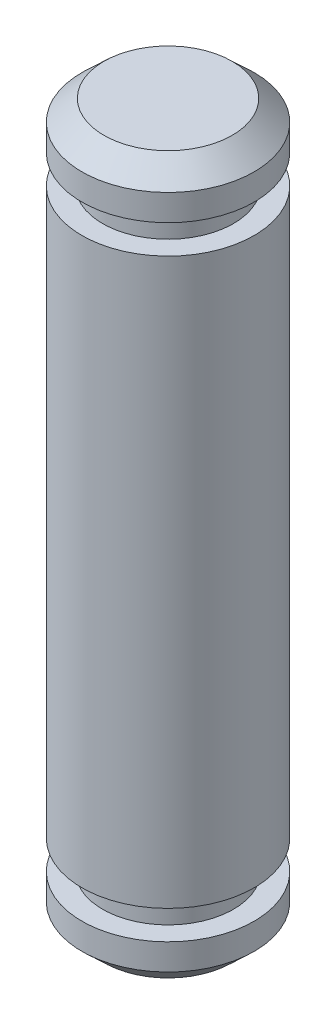
ISO-10303-21;
HEADER;
FILE_DESCRIPTION(('STEP AP214'),'2;1');
FILE_NAME('part.step','',(''),(''),'','','');
FILE_SCHEMA(('AUTOMOTIVE_DESIGN { 1 0 10303 214 1 1 1 1 }'));
ENDSEC;
DATA;
#1=APPLICATION_CONTEXT('core data for automotive mechanical design processes');
#2=APPLICATION_PROTOCOL_DEFINITION('international standard','automotive_design',2000,#1);
#3=PRODUCT_CONTEXT('',#1,'mechanical');
#4=PRODUCT('Part','Part','',(#3));
#5=PRODUCT_RELATED_PRODUCT_CATEGORY('part','',(#4));
#6=PRODUCT_DEFINITION_FORMATION('','',#4);
#7=PRODUCT_DEFINITION_CONTEXT('part definition',#1,'design');
#8=PRODUCT_DEFINITION('design','',#6,#7);
#9=PRODUCT_DEFINITION_SHAPE('','',#8);
#10=(LENGTH_UNIT() NAMED_UNIT(*) SI_UNIT(.MILLI.,.METRE.));
#11=(NAMED_UNIT(*) PLANE_ANGLE_UNIT() SI_UNIT($,.RADIAN.));
#12=(NAMED_UNIT(*) SI_UNIT($,.STERADIAN.) SOLID_ANGLE_UNIT());
#13=UNCERTAINTY_MEASURE_WITH_UNIT(LENGTH_MEASURE(1.E-05),#10,'distance_accuracy_value','');
#14=(GEOMETRIC_REPRESENTATION_CONTEXT(3) GLOBAL_UNCERTAINTY_ASSIGNED_CONTEXT((#13)) GLOBAL_UNIT_ASSIGNED_CONTEXT((#10,
#11,#12)) REPRESENTATION_CONTEXT('',''));
#15=CARTESIAN_POINT('',(0.,0.,0.));
#16=DIRECTION('',(0.,0.,1.));
#17=DIRECTION('',(1.,0.,0.));
#18=AXIS2_PLACEMENT_3D('',#15,#16,#17);
#19=CARTESIAN_POINT('',(-1.5875,5.207,0.));
#20=DIRECTION('',(0.,-1.,0.));
#21=DIRECTION('',(0.,0.,-1.));
#22=AXIS2_PLACEMENT_3D('',#19,#20,#21);
#23=PLANE('',#22);
#24=CARTESIAN_POINT('',(0.,5.207,0.));
#25=DIRECTION('',(0.,-1.,0.));
#26=DIRECTION('',(0.,0.,-1.));
#27=AXIS2_PLACEMENT_3D('',#24,#25,#26);
#28=CIRCLE('',#27,1.5875);
#29=CARTESIAN_POINT('',(0.,5.207,-1.5875));
#30=VERTEX_POINT('',#29);
#31=EDGE_CURVE('E10',#30,#30,#28,.T.);
#32=ORIENTED_EDGE('',*,*,#31,.F.);
#33=EDGE_LOOP('',(#32));
#34=FACE_BOUND('',#33,.T.);
#35=CARTESIAN_POINT('',(0.,5.207,0.));
#36=DIRECTION('',(0.,-1.,0.));
#37=DIRECTION('',(0.,0.,-1.));
#38=AXIS2_PLACEMENT_3D('',#35,#36,#37);
#39=CIRCLE('',#38,1.2065);
#40=CARTESIAN_POINT('',(0.,5.207,-1.2065));
#41=VERTEX_POINT('',#40);
#42=EDGE_CURVE('E71',#41,#41,#39,.T.);
#43=ORIENTED_EDGE('',*,*,#42,.T.);
#44=EDGE_LOOP('',(#43));
#45=FACE_BOUND('',#44,.T.);
#46=ADVANCED_FACE('F31',(#34,#45),#23,.F.);
#47=CARTESIAN_POINT('',(0.,0.,0.));
#48=DIRECTION('',(0.,-1.,0.));
#49=DIRECTION('',(0.,0.,-1.));
#50=AXIS2_PLACEMENT_3D('',#47,#48,#49);
#51=CYLINDRICAL_SURFACE('',#50,1.5875);
#52=CARTESIAN_POINT('',(0.,-5.207,0.));
#53=DIRECTION('',(0.,-1.,0.));
#54=DIRECTION('',(0.,0.,-1.));
#55=AXIS2_PLACEMENT_3D('',#52,#53,#54);
#56=CIRCLE('',#55,1.5875);
#57=CARTESIAN_POINT('',(0.,-5.207,-1.5875));
#58=VERTEX_POINT('',#57);
#59=EDGE_CURVE('E37',#58,#58,#56,.T.);
#60=ORIENTED_EDGE('',*,*,#59,.F.);
#61=EDGE_LOOP('',(#60));
#62=FACE_BOUND('',#61,.T.);
#63=ORIENTED_EDGE('',*,*,#31,.T.);
#64=EDGE_LOOP('',(#63));
#65=FACE_BOUND('',#64,.T.);
#66=ADVANCED_FACE('F111',(#62,#65),#51,.T.);
#67=CARTESIAN_POINT('',(-1.5875,-5.207,0.));
#68=DIRECTION('',(0.,1.,0.));
#69=DIRECTION('',(0.,0.,1.));
#70=AXIS2_PLACEMENT_3D('',#67,#68,#69);
#71=PLANE('',#70);
#72=CARTESIAN_POINT('',(0.,-5.207,0.));
#73=DIRECTION('',(0.,-1.,0.));
#74=DIRECTION('',(0.,0.,-1.));
#75=AXIS2_PLACEMENT_3D('',#72,#73,#74);
#76=CIRCLE('',#75,1.2065);
#77=CARTESIAN_POINT('',(0.,-5.207,-1.2065));
#78=VERTEX_POINT('',#77);
#79=EDGE_CURVE('E41',#78,#78,#76,.T.);
#80=ORIENTED_EDGE('',*,*,#79,.F.);
#81=EDGE_LOOP('',(#80));
#82=FACE_BOUND('',#81,.T.);
#83=ORIENTED_EDGE('',*,*,#59,.T.);
#84=EDGE_LOOP('',(#83));
#85=FACE_BOUND('',#84,.T.);
#86=ADVANCED_FACE('F116',(#82,#85),#71,.F.);
#87=CARTESIAN_POINT('',(0.,0.,0.));
#88=DIRECTION('',(0.,-1.,0.));
#89=DIRECTION('',(0.,0.,-1.));
#90=AXIS2_PLACEMENT_3D('',#87,#88,#89);
#91=CYLINDRICAL_SURFACE('',#90,1.2065);
#92=CARTESIAN_POINT('',(0.,-5.7404,0.));
#93=DIRECTION('',(0.,-1.,0.));
#94=DIRECTION('',(0.,0.,-1.));
#95=AXIS2_PLACEMENT_3D('',#92,#93,#94);
#96=CIRCLE('',#95,1.2065);
#97=CARTESIAN_POINT('',(0.,-5.7404,-1.2065));
#98=VERTEX_POINT('',#97);
#99=EDGE_CURVE('E45',#98,#98,#96,.T.);
#100=ORIENTED_EDGE('',*,*,#99,.F.);
#101=EDGE_LOOP('',(#100));
#102=FACE_BOUND('',#101,.T.);
#103=ORIENTED_EDGE('',*,*,#79,.T.);
#104=EDGE_LOOP('',(#103));
#105=FACE_BOUND('',#104,.T.);
#106=ADVANCED_FACE('F121',(#102,#105),#91,.T.);
#107=CARTESIAN_POINT('',(-1.2065,-5.7404,0.));
#108=DIRECTION('',(0.,-1.,0.));
#109=DIRECTION('',(0.,0.,-1.));
#110=AXIS2_PLACEMENT_3D('',#107,#108,#109);
#111=PLANE('',#110);
#112=CARTESIAN_POINT('',(0.,-5.7404,0.));
#113=DIRECTION('',(0.,-1.,0.));
#114=DIRECTION('',(0.,0.,-1.));
#115=AXIS2_PLACEMENT_3D('',#112,#113,#114);
#116=CIRCLE('',#115,1.5875);
#117=CARTESIAN_POINT('',(0.,-5.7404,-1.5875));
#118=VERTEX_POINT('',#117);
#119=EDGE_CURVE('E50',#118,#118,#116,.T.);
#120=ORIENTED_EDGE('',*,*,#119,.F.);
#121=EDGE_LOOP('',(#120));
#122=FACE_BOUND('',#121,.T.);
#123=ORIENTED_EDGE('',*,*,#99,.T.);
#124=EDGE_LOOP('',(#123));
#125=FACE_BOUND('',#124,.T.);
#126=ADVANCED_FACE('F127',(#122,#125),#111,.F.);
#127=CARTESIAN_POINT('',(0.,0.,0.));
#128=DIRECTION('',(0.,-1.,0.));
#129=DIRECTION('',(0.,0.,-1.));
#130=AXIS2_PLACEMENT_3D('',#127,#128,#129);
#131=CYLINDRICAL_SURFACE('',#130,1.5875);
#132=CARTESIAN_POINT('',(0.,-6.223,0.));
#133=DIRECTION('',(0.,-1.,0.));
#134=DIRECTION('',(0.,0.,-1.));
#135=AXIS2_PLACEMENT_3D('',#132,#133,#134);
#136=CIRCLE('',#135,1.5875);
#137=CARTESIAN_POINT('',(0.,-6.223,-1.5875));
#138=VERTEX_POINT('',#137);
#139=EDGE_CURVE('E53',#138,#138,#136,.T.);
#140=ORIENTED_EDGE('',*,*,#139,.F.);
#141=EDGE_LOOP('',(#140));
#142=FACE_BOUND('',#141,.T.);
#143=ORIENTED_EDGE('',*,*,#119,.T.);
#144=EDGE_LOOP('',(#143));
#145=FACE_BOUND('',#144,.T.);
#146=ADVANCED_FACE('F131',(#142,#145),#131,.T.);
#147=CARTESIAN_POINT('',(0.,-6.223,0.));
#148=DIRECTION('',(0.,1.,0.));
#149=DIRECTION('',(0.,0.,1.));
#150=AXIS2_PLACEMENT_3D('',#147,#148,#149);
#151=CONICAL_SURFACE('',#150,1.5875,0.815568544068997);
#152=CARTESIAN_POINT('',(0.,-6.604,0.));
#153=DIRECTION('',(0.,-1.,0.));
#154=DIRECTION('',(0.,0.,-1.));
#155=AXIS2_PLACEMENT_3D('',#152,#153,#154);
#156=CIRCLE('',#155,1.18278756142947);
#157=CARTESIAN_POINT('',(0.,-6.604,-1.18278756142947));
#158=VERTEX_POINT('',#157);
#159=EDGE_CURVE('E56',#158,#158,#156,.T.);
#160=ORIENTED_EDGE('',*,*,#159,.F.);
#161=EDGE_LOOP('',(#160));
#162=FACE_BOUND('',#161,.T.);
#163=ORIENTED_EDGE('',*,*,#139,.T.);
#164=EDGE_LOOP('',(#163));
#165=FACE_BOUND('',#164,.T.);
#166=ADVANCED_FACE('F107',(#162,#165),#151,.T.);
#167=CARTESIAN_POINT('',(-1.18278756142947,-6.604,0.));
#168=DIRECTION('',(0.,1.,0.));
#169=DIRECTION('',(0.,0.,1.));
#170=AXIS2_PLACEMENT_3D('',#167,#168,#169);
#171=PLANE('',#170);
#172=ORIENTED_EDGE('',*,*,#159,.T.);
#173=EDGE_LOOP('',(#172));
#174=FACE_BOUND('',#173,.T.);
#175=ADVANCED_FACE('F102',(#174),#171,.F.);
#176=CARTESIAN_POINT('',(-1.18278756142947,6.604,0.));
#177=DIRECTION('',(0.,-1.,0.));
#178=DIRECTION('',(0.,0.,-1.));
#179=AXIS2_PLACEMENT_3D('',#176,#177,#178);
#180=PLANE('',#179);
#181=CARTESIAN_POINT('',(0.,6.604,0.));
#182=DIRECTION('',(0.,-1.,0.));
#183=DIRECTION('',(0.,0.,-1.));
#184=AXIS2_PLACEMENT_3D('',#181,#182,#183);
#185=CIRCLE('',#184,1.18278756142947);
#186=CARTESIAN_POINT('',(0.,6.604,-1.18278756142947));
#187=VERTEX_POINT('',#186);
#188=EDGE_CURVE('E59',#187,#187,#185,.T.);
#189=ORIENTED_EDGE('',*,*,#188,.F.);
#190=EDGE_LOOP('',(#189));
#191=FACE_BOUND('',#190,.T.);
#192=ADVANCED_FACE('F97',(#191),#180,.F.);
#193=CARTESIAN_POINT('',(0.,6.604,0.));
#194=DIRECTION('',(0.,-1.,0.));
#195=DIRECTION('',(0.,0.,-1.));
#196=AXIS2_PLACEMENT_3D('',#193,#194,#195);
#197=CONICAL_SURFACE('',#196,1.18278756142947,0.815568544068997);
#198=CARTESIAN_POINT('',(0.,6.223,0.));
#199=DIRECTION('',(0.,-1.,0.));
#200=DIRECTION('',(0.,0.,-1.));
#201=AXIS2_PLACEMENT_3D('',#198,#199,#200);
#202=CIRCLE('',#201,1.5875);
#203=CARTESIAN_POINT('',(0.,6.223,-1.5875));
#204=VERTEX_POINT('',#203);
#205=EDGE_CURVE('E62',#204,#204,#202,.T.);
#206=ORIENTED_EDGE('',*,*,#205,.F.);
#207=EDGE_LOOP('',(#206));
#208=FACE_BOUND('',#207,.T.);
#209=ORIENTED_EDGE('',*,*,#188,.T.);
#210=EDGE_LOOP('',(#209));
#211=FACE_BOUND('',#210,.T.);
#212=ADVANCED_FACE('F91',(#208,#211),#197,.T.);
#213=CARTESIAN_POINT('',(0.,0.,0.));
#214=DIRECTION('',(0.,-1.,0.));
#215=DIRECTION('',(0.,0.,-1.));
#216=AXIS2_PLACEMENT_3D('',#213,#214,#215);
#217=CYLINDRICAL_SURFACE('',#216,1.5875);
#218=CARTESIAN_POINT('',(0.,5.7404,0.));
#219=DIRECTION('',(0.,-1.,0.));
#220=DIRECTION('',(0.,0.,-1.));
#221=AXIS2_PLACEMENT_3D('',#218,#219,#220);
#222=CIRCLE('',#221,1.5875);
#223=CARTESIAN_POINT('',(0.,5.7404,-1.5875));
#224=VERTEX_POINT('',#223);
#225=EDGE_CURVE('E65',#224,#224,#222,.T.);
#226=ORIENTED_EDGE('',*,*,#225,.F.);
#227=EDGE_LOOP('',(#226));
#228=FACE_BOUND('',#227,.T.);
#229=ORIENTED_EDGE('',*,*,#205,.T.);
#230=EDGE_LOOP('',(#229));
#231=FACE_BOUND('',#230,.T.);
#232=ADVANCED_FACE('F85',(#228,#231),#217,.T.);
#233=CARTESIAN_POINT('',(-1.2065,5.7404,0.));
#234=DIRECTION('',(0.,1.,0.));
#235=DIRECTION('',(0.,0.,1.));
#236=AXIS2_PLACEMENT_3D('',#233,#234,#235);
#237=PLANE('',#236);
#238=CARTESIAN_POINT('',(0.,5.7404,0.));
#239=DIRECTION('',(0.,-1.,0.));
#240=DIRECTION('',(0.,0.,-1.));
#241=AXIS2_PLACEMENT_3D('',#238,#239,#240);
#242=CIRCLE('',#241,1.2065);
#243=CARTESIAN_POINT('',(0.,5.7404,-1.2065));
#244=VERTEX_POINT('',#243);
#245=EDGE_CURVE('E68',#244,#244,#242,.T.);
#246=ORIENTED_EDGE('',*,*,#245,.F.);
#247=EDGE_LOOP('',(#246));
#248=FACE_BOUND('',#247,.T.);
#249=ORIENTED_EDGE('',*,*,#225,.T.);
#250=EDGE_LOOP('',(#249));
#251=FACE_BOUND('',#250,.T.);
#252=ADVANCED_FACE('F79',(#248,#251),#237,.F.);
#253=CARTESIAN_POINT('',(0.,0.,0.));
#254=DIRECTION('',(0.,-1.,0.));
#255=DIRECTION('',(0.,0.,-1.));
#256=AXIS2_PLACEMENT_3D('',#253,#254,#255);
#257=CYLINDRICAL_SURFACE('',#256,1.2065);
#258=ORIENTED_EDGE('',*,*,#42,.F.);
#259=EDGE_LOOP('',(#258));
#260=FACE_BOUND('',#259,.T.);
#261=ORIENTED_EDGE('',*,*,#245,.T.);
#262=EDGE_LOOP('',(#261));
#263=FACE_BOUND('',#262,.T.);
#264=ADVANCED_FACE('F76',(#260,#263),#257,.T.);
#265=CLOSED_SHELL('',(#46,#66,#86,#106,#126,#146,#166,#175,#192,#212,#232,#252,#264));
#266=MANIFOLD_SOLID_BREP('B2',#265);
#267=ADVANCED_BREP_SHAPE_REPRESENTATION('',(#18,#266),#14);
#268=SHAPE_DEFINITION_REPRESENTATION(#9,#267);
ENDSEC;
END-ISO-10303-21;
